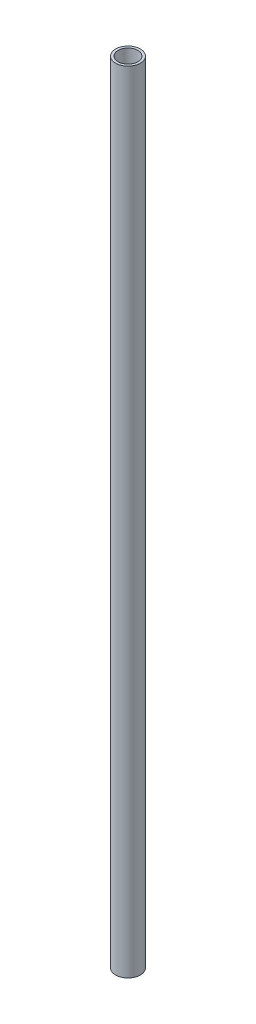
ISO-10303-21;
HEADER;
FILE_DESCRIPTION(('STEP AP214'),'2;1');
FILE_NAME('part.step','',(''),(''),'','','');
FILE_SCHEMA(('AUTOMOTIVE_DESIGN { 1 0 10303 214 1 1 1 1 }'));
ENDSEC;
DATA;
#1=APPLICATION_CONTEXT('core data for automotive mechanical design processes');
#2=APPLICATION_PROTOCOL_DEFINITION('international standard','automotive_design',2000,#1);
#3=PRODUCT_CONTEXT('',#1,'mechanical');
#4=PRODUCT('Part','Part','',(#3));
#5=PRODUCT_RELATED_PRODUCT_CATEGORY('part','',(#4));
#6=PRODUCT_DEFINITION_FORMATION('','',#4);
#7=PRODUCT_DEFINITION_CONTEXT('part definition',#1,'design');
#8=PRODUCT_DEFINITION('design','',#6,#7);
#9=PRODUCT_DEFINITION_SHAPE('','',#8);
#10=(LENGTH_UNIT() NAMED_UNIT(*) SI_UNIT(.MILLI.,.METRE.));
#11=(NAMED_UNIT(*) PLANE_ANGLE_UNIT() SI_UNIT($,.RADIAN.));
#12=(NAMED_UNIT(*) SI_UNIT($,.STERADIAN.) SOLID_ANGLE_UNIT());
#13=UNCERTAINTY_MEASURE_WITH_UNIT(LENGTH_MEASURE(1.E-05),#10,'distance_accuracy_value','');
#14=(GEOMETRIC_REPRESENTATION_CONTEXT(3) GLOBAL_UNCERTAINTY_ASSIGNED_CONTEXT((#13)) GLOBAL_UNIT_ASSIGNED_CONTEXT((#10,
#11,#12)) REPRESENTATION_CONTEXT('',''));
#15=CARTESIAN_POINT('',(0.,0.,0.));
#16=DIRECTION('',(0.,0.,1.));
#17=DIRECTION('',(1.,0.,0.));
#18=AXIS2_PLACEMENT_3D('',#15,#16,#17);
#19=CARTESIAN_POINT('',(0.,508.,0.));
#20=DIRECTION('',(0.,1.,0.));
#21=DIRECTION('',(0.,0.,1.));
#22=AXIS2_PLACEMENT_3D('',#19,#20,#21);
#23=PLANE('',#22);
#24=CARTESIAN_POINT('',(0.,508.,0.));
#25=DIRECTION('',(0.,1.,0.));
#26=DIRECTION('',(0.,0.,1.));
#27=AXIS2_PLACEMENT_3D('',#24,#25,#26);
#28=CIRCLE('',#27,7.9375);
#29=CARTESIAN_POINT('',(0.,508.,7.9375));
#30=VERTEX_POINT('',#29);
#31=EDGE_CURVE('E10',#30,#30,#28,.T.);
#32=ORIENTED_EDGE('',*,*,#31,.T.);
#33=EDGE_LOOP('',(#32));
#34=FACE_BOUND('',#33,.T.);
#35=CARTESIAN_POINT('',(0.,508.,0.));
#36=DIRECTION('',(0.,1.,0.));
#37=DIRECTION('',(0.,0.,1.));
#38=AXIS2_PLACEMENT_3D('',#35,#36,#37);
#39=CIRCLE('',#38,6.35);
#40=CARTESIAN_POINT('',(0.,508.,6.35));
#41=VERTEX_POINT('',#40);
#42=EDGE_CURVE('E44',#41,#41,#39,.T.);
#43=ORIENTED_EDGE('',*,*,#42,.F.);
#44=EDGE_LOOP('',(#43));
#45=FACE_BOUND('',#44,.T.);
#46=ADVANCED_FACE('F33',(#34,#45),#23,.T.);
#47=CARTESIAN_POINT('',(0.,0.,0.));
#48=DIRECTION('',(0.,1.,0.));
#49=DIRECTION('',(0.,0.,1.));
#50=AXIS2_PLACEMENT_3D('',#47,#48,#49);
#51=PLANE('',#50);
#52=CARTESIAN_POINT('',(0.,0.,0.));
#53=DIRECTION('',(0.,1.,0.));
#54=DIRECTION('',(0.,0.,1.));
#55=AXIS2_PLACEMENT_3D('',#52,#53,#54);
#56=CIRCLE('',#55,7.9375);
#57=CARTESIAN_POINT('',(0.,0.,7.9375));
#58=VERTEX_POINT('',#57);
#59=EDGE_CURVE('E37',#58,#58,#56,.T.);
#60=ORIENTED_EDGE('',*,*,#59,.F.);
#61=EDGE_LOOP('',(#60));
#62=FACE_BOUND('',#61,.T.);
#63=CARTESIAN_POINT('',(0.,0.,0.));
#64=DIRECTION('',(0.,1.,0.));
#65=DIRECTION('',(0.,0.,1.));
#66=AXIS2_PLACEMENT_3D('',#63,#64,#65);
#67=CIRCLE('',#66,6.35);
#68=CARTESIAN_POINT('',(0.,0.,6.35));
#69=VERTEX_POINT('',#68);
#70=EDGE_CURVE('E46',#69,#69,#67,.T.);
#71=ORIENTED_EDGE('',*,*,#70,.T.);
#72=EDGE_LOOP('',(#71));
#73=FACE_BOUND('',#72,.T.);
#74=ADVANCED_FACE('F56',(#62,#73),#51,.F.);
#75=CARTESIAN_POINT('',(0.,508.,0.));
#76=DIRECTION('',(0.,-1.,0.));
#77=DIRECTION('',(0.,0.,-1.));
#78=AXIS2_PLACEMENT_3D('',#75,#76,#77);
#79=CYLINDRICAL_SURFACE('',#78,7.9375);
#80=ORIENTED_EDGE('',*,*,#31,.F.);
#81=EDGE_LOOP('',(#80));
#82=FACE_BOUND('',#81,.T.);
#83=ORIENTED_EDGE('',*,*,#59,.T.);
#84=EDGE_LOOP('',(#83));
#85=FACE_BOUND('',#84,.T.);
#86=ADVANCED_FACE('F35',(#82,#85),#79,.T.);
#87=CARTESIAN_POINT('',(0.,508.,0.));
#88=DIRECTION('',(0.,-1.,0.));
#89=DIRECTION('',(0.,0.,-1.));
#90=AXIS2_PLACEMENT_3D('',#87,#88,#89);
#91=CYLINDRICAL_SURFACE('',#90,6.35);
#92=ORIENTED_EDGE('',*,*,#42,.T.);
#93=EDGE_LOOP('',(#92));
#94=FACE_BOUND('',#93,.T.);
#95=ORIENTED_EDGE('',*,*,#70,.F.);
#96=EDGE_LOOP('',(#95));
#97=FACE_BOUND('',#96,.T.);
#98=ADVANCED_FACE('F52',(#94,#97),#91,.F.);
#99=CLOSED_SHELL('',(#46,#74,#86,#98));
#100=MANIFOLD_SOLID_BREP('B2',#99);
#101=ADVANCED_BREP_SHAPE_REPRESENTATION('',(#18,#100),#14);
#102=SHAPE_DEFINITION_REPRESENTATION(#9,#101);
ENDSEC;
END-ISO-10303-21;
